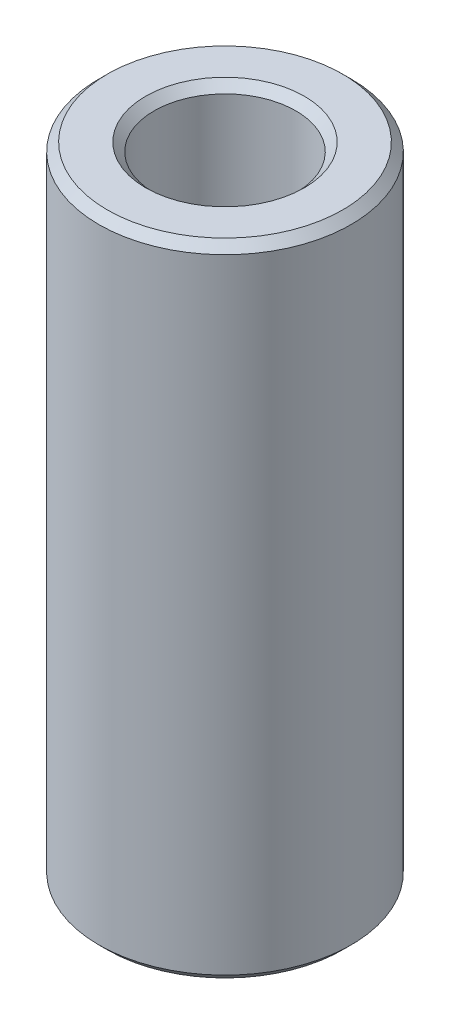
ISO-10303-21;
HEADER;
FILE_DESCRIPTION(('STEP AP214'),'2;1');
FILE_NAME('part.step','',(''),(''),'','','');
FILE_SCHEMA(('AUTOMOTIVE_DESIGN { 1 0 10303 214 1 1 1 1 }'));
ENDSEC;
DATA;
#1=APPLICATION_CONTEXT('core data for automotive mechanical design processes');
#2=APPLICATION_PROTOCOL_DEFINITION('international standard','automotive_design',2000,#1);
#3=PRODUCT_CONTEXT('',#1,'mechanical');
#4=PRODUCT('Part','Part','',(#3));
#5=PRODUCT_RELATED_PRODUCT_CATEGORY('part','',(#4));
#6=PRODUCT_DEFINITION_FORMATION('','',#4);
#7=PRODUCT_DEFINITION_CONTEXT('part definition',#1,'design');
#8=PRODUCT_DEFINITION('design','',#6,#7);
#9=PRODUCT_DEFINITION_SHAPE('','',#8);
#10=(LENGTH_UNIT() NAMED_UNIT(*) SI_UNIT(.MILLI.,.METRE.));
#11=(NAMED_UNIT(*) PLANE_ANGLE_UNIT() SI_UNIT($,.RADIAN.));
#12=(NAMED_UNIT(*) SI_UNIT($,.STERADIAN.) SOLID_ANGLE_UNIT());
#13=UNCERTAINTY_MEASURE_WITH_UNIT(LENGTH_MEASURE(1.E-05),#10,'distance_accuracy_value','');
#14=(GEOMETRIC_REPRESENTATION_CONTEXT(3) GLOBAL_UNCERTAINTY_ASSIGNED_CONTEXT((#13)) GLOBAL_UNIT_ASSIGNED_CONTEXT((#10,
#11,#12)) REPRESENTATION_CONTEXT('',''));
#15=CARTESIAN_POINT('',(0.,0.,0.));
#16=DIRECTION('',(0.,0.,1.));
#17=DIRECTION('',(1.,0.,0.));
#18=AXIS2_PLACEMENT_3D('',#15,#16,#17);
#19=CARTESIAN_POINT('',(0.,241.330209341049,0.));
#20=DIRECTION('',(0.,-1.,0.));
#21=DIRECTION('',(0.,0.,-1.));
#22=AXIS2_PLACEMENT_3D('',#19,#20,#21);
#23=CYLINDRICAL_SURFACE('',#22,47.5);
#24=CARTESIAN_POINT('',(0.,3.18069927229483,0.));
#25=DIRECTION('',(0.,1.,0.));
#26=DIRECTION('',(0.,0.,1.));
#27=AXIS2_PLACEMENT_3D('',#24,#25,#26);
#28=CIRCLE('',#27,47.5);
#29=CARTESIAN_POINT('',(0.,3.18069927229483,47.5));
#30=VERTEX_POINT('',#29);
#31=EDGE_CURVE('E10',#30,#30,#28,.T.);
#32=ORIENTED_EDGE('',*,*,#31,.T.);
#33=EDGE_LOOP('',(#32));
#34=FACE_BOUND('',#33,.T.);
#35=CARTESIAN_POINT('',(0.,238.149510068754,0.));
#36=DIRECTION('',(0.,1.,0.));
#37=DIRECTION('',(0.,0.,1.));
#38=AXIS2_PLACEMENT_3D('',#35,#36,#37);
#39=CIRCLE('',#38,47.5);
#40=CARTESIAN_POINT('',(0.,238.149510068754,47.5));
#41=VERTEX_POINT('',#40);
#42=EDGE_CURVE('E50',#41,#41,#39,.F.);
#43=ORIENTED_EDGE('',*,*,#42,.T.);
#44=EDGE_LOOP('',(#43));
#45=FACE_BOUND('',#44,.T.);
#46=ADVANCED_FACE('F39',(#34,#45),#23,.T.);
#47=CARTESIAN_POINT('',(0.,241.330209341049,0.));
#48=DIRECTION('',(0.,1.,0.));
#49=DIRECTION('',(0.,0.,1.));
#50=AXIS2_PLACEMENT_3D('',#47,#48,#49);
#51=PLANE('',#50);
#52=CARTESIAN_POINT('',(0.,241.330209341049,0.));
#53=DIRECTION('',(0.,1.,0.));
#54=DIRECTION('',(0.,0.,1.));
#55=AXIS2_PLACEMENT_3D('',#52,#53,#54);
#56=CIRCLE('',#55,29.8926415665875);
#57=CARTESIAN_POINT('',(0.,241.330209341049,29.8926415665875));
#58=VERTEX_POINT('',#57);
#59=EDGE_CURVE('E58',#58,#58,#56,.F.);
#60=ORIENTED_EDGE('',*,*,#59,.T.);
#61=EDGE_LOOP('',(#60));
#62=FACE_BOUND('',#61,.T.);
#63=CARTESIAN_POINT('',(0.,241.330209341049,0.));
#64=DIRECTION('',(0.,1.,0.));
#65=DIRECTION('',(0.,0.,1.));
#66=AXIS2_PLACEMENT_3D('',#63,#64,#65);
#67=CIRCLE('',#66,44.3193007277052);
#68=CARTESIAN_POINT('',(0.,241.330209341049,44.3193007277052));
#69=VERTEX_POINT('',#68);
#70=EDGE_CURVE('E61',#69,#69,#67,.T.);
#71=ORIENTED_EDGE('',*,*,#70,.T.);
#72=EDGE_LOOP('',(#71));
#73=FACE_BOUND('',#72,.T.);
#74=ADVANCED_FACE('F88',(#62,#73),#51,.T.);
#75=CARTESIAN_POINT('',(0.,0.,0.));
#76=DIRECTION('',(0.,1.,0.));
#77=DIRECTION('',(0.,0.,1.));
#78=AXIS2_PLACEMENT_3D('',#75,#76,#77);
#79=PLANE('',#78);
#80=CARTESIAN_POINT('',(0.,0.,0.));
#81=DIRECTION('',(0.,1.,0.));
#82=DIRECTION('',(0.,0.,1.));
#83=AXIS2_PLACEMENT_3D('',#80,#81,#82);
#84=CIRCLE('',#83,29.8926415665875);
#85=CARTESIAN_POINT('',(0.,0.,29.8926415665875));
#86=VERTEX_POINT('',#85);
#87=EDGE_CURVE('E51',#86,#86,#84,.T.);
#88=ORIENTED_EDGE('',*,*,#87,.T.);
#89=EDGE_LOOP('',(#88));
#90=FACE_BOUND('',#89,.T.);
#91=CARTESIAN_POINT('',(0.,0.,0.));
#92=DIRECTION('',(0.,1.,0.));
#93=DIRECTION('',(0.,0.,1.));
#94=AXIS2_PLACEMENT_3D('',#91,#92,#93);
#95=CIRCLE('',#94,44.3193007277052);
#96=CARTESIAN_POINT('',(0.,0.,44.3193007277052));
#97=VERTEX_POINT('',#96);
#98=EDGE_CURVE('E54',#97,#97,#95,.F.);
#99=ORIENTED_EDGE('',*,*,#98,.T.);
#100=EDGE_LOOP('',(#99));
#101=FACE_BOUND('',#100,.T.);
#102=ADVANCED_FACE('F83',(#90,#101),#79,.F.);
#103=CARTESIAN_POINT('',(0.,241.330209341049,0.));
#104=DIRECTION('',(0.,-1.,0.));
#105=DIRECTION('',(0.,0.,-1.));
#106=AXIS2_PLACEMENT_3D('',#103,#104,#105);
#107=CYLINDRICAL_SURFACE('',#106,26.7119422942926);
#108=CARTESIAN_POINT('',(0.,238.149510068754,0.));
#109=DIRECTION('',(0.,1.,0.));
#110=DIRECTION('',(0.,0.,1.));
#111=AXIS2_PLACEMENT_3D('',#108,#109,#110);
#112=CIRCLE('',#111,26.7119422942926);
#113=CARTESIAN_POINT('',(0.,238.149510068754,26.7119422942926));
#114=VERTEX_POINT('',#113);
#115=EDGE_CURVE('E67',#114,#114,#112,.T.);
#116=ORIENTED_EDGE('',*,*,#115,.T.);
#117=EDGE_LOOP('',(#116));
#118=FACE_BOUND('',#117,.T.);
#119=CARTESIAN_POINT('',(0.,3.18069927229489,0.));
#120=DIRECTION('',(0.,1.,0.));
#121=DIRECTION('',(0.,0.,1.));
#122=AXIS2_PLACEMENT_3D('',#119,#120,#121);
#123=CIRCLE('',#122,26.7119422942926);
#124=CARTESIAN_POINT('',(0.,3.18069927229489,26.7119422942926));
#125=VERTEX_POINT('',#124);
#126=EDGE_CURVE('E69',#125,#125,#123,.F.);
#127=ORIENTED_EDGE('',*,*,#126,.T.);
#128=EDGE_LOOP('',(#127));
#129=FACE_BOUND('',#128,.T.);
#130=ADVANCED_FACE('F71',(#118,#129),#107,.F.);
#131=CARTESIAN_POINT('',(0.,238.149510068754,0.));
#132=DIRECTION('',(0.,1.,0.));
#133=DIRECTION('',(0.,0.,1.));
#134=AXIS2_PLACEMENT_3D('',#131,#132,#133);
#135=CONICAL_SURFACE('',#134,26.7119422942926,0.785398163397447);
#136=ORIENTED_EDGE('',*,*,#59,.F.);
#137=EDGE_LOOP('',(#136));
#138=FACE_BOUND('',#137,.T.);
#139=ORIENTED_EDGE('',*,*,#115,.F.);
#140=EDGE_LOOP('',(#139));
#141=FACE_BOUND('',#140,.T.);
#142=ADVANCED_FACE('F77',(#138,#141),#135,.F.);
#143=CARTESIAN_POINT('',(0.,0.,0.));
#144=DIRECTION('',(0.,-1.,0.));
#145=DIRECTION('',(0.,0.,-1.));
#146=AXIS2_PLACEMENT_3D('',#143,#144,#145);
#147=CONICAL_SURFACE('',#146,29.8926415665875,0.785398163397447);
#148=ORIENTED_EDGE('',*,*,#126,.F.);
#149=EDGE_LOOP('',(#148));
#150=FACE_BOUND('',#149,.T.);
#151=ORIENTED_EDGE('',*,*,#87,.F.);
#152=EDGE_LOOP('',(#151));
#153=FACE_BOUND('',#152,.T.);
#154=ADVANCED_FACE('F73',(#150,#153),#147,.F.);
#155=CARTESIAN_POINT('',(0.,3.18069927229483,0.));
#156=DIRECTION('',(0.,1.,0.));
#157=DIRECTION('',(0.,0.,1.));
#158=AXIS2_PLACEMENT_3D('',#155,#156,#157);
#159=CONICAL_SURFACE('',#158,47.5,0.785398163397452);
#160=ORIENTED_EDGE('',*,*,#98,.F.);
#161=EDGE_LOOP('',(#160));
#162=FACE_BOUND('',#161,.T.);
#163=ORIENTED_EDGE('',*,*,#31,.F.);
#164=EDGE_LOOP('',(#163));
#165=FACE_BOUND('',#164,.T.);
#166=ADVANCED_FACE('F76',(#162,#165),#159,.T.);
#167=CARTESIAN_POINT('',(0.,241.330209341049,0.));
#168=DIRECTION('',(0.,-1.,0.));
#169=DIRECTION('',(0.,0.,-1.));
#170=AXIS2_PLACEMENT_3D('',#167,#168,#169);
#171=CONICAL_SURFACE('',#170,44.3193007277052,0.785398163397443);
#172=ORIENTED_EDGE('',*,*,#42,.F.);
#173=EDGE_LOOP('',(#172));
#174=FACE_BOUND('',#173,.T.);
#175=ORIENTED_EDGE('',*,*,#70,.F.);
#176=EDGE_LOOP('',(#175));
#177=FACE_BOUND('',#176,.T.);
#178=ADVANCED_FACE('F45',(#174,#177),#171,.T.);
#179=CLOSED_SHELL('',(#46,#74,#102,#130,#142,#154,#166,#178));
#180=MANIFOLD_SOLID_BREP('B2',#179);
#181=ADVANCED_BREP_SHAPE_REPRESENTATION('',(#18,#180),#14);
#182=SHAPE_DEFINITION_REPRESENTATION(#9,#181);
ENDSEC;
END-ISO-10303-21;
